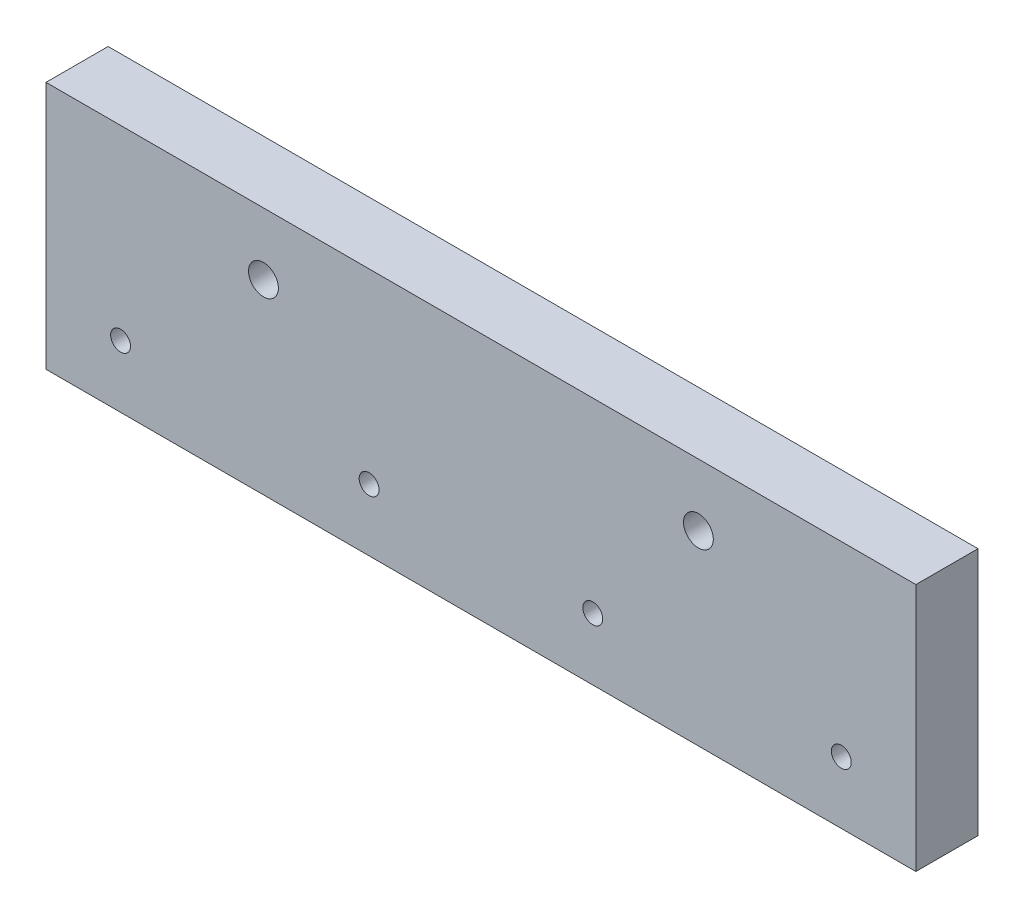
ISO-10303-21;
HEADER;
FILE_DESCRIPTION(('STEP AP214'),'2;1');
FILE_NAME('part.step','',(''),(''),'','','');
FILE_SCHEMA(('AUTOMOTIVE_DESIGN { 1 0 10303 214 1 1 1 1 }'));
ENDSEC;
DATA;
#1=APPLICATION_CONTEXT('core data for automotive mechanical design processes');
#2=APPLICATION_PROTOCOL_DEFINITION('international standard','automotive_design',2000,#1);
#3=PRODUCT_CONTEXT('',#1,'mechanical');
#4=PRODUCT('Part','Part','',(#3));
#5=PRODUCT_RELATED_PRODUCT_CATEGORY('part','',(#4));
#6=PRODUCT_DEFINITION_FORMATION('','',#4);
#7=PRODUCT_DEFINITION_CONTEXT('part definition',#1,'design');
#8=PRODUCT_DEFINITION('design','',#6,#7);
#9=PRODUCT_DEFINITION_SHAPE('','',#8);
#10=(LENGTH_UNIT() NAMED_UNIT(*) SI_UNIT(.MILLI.,.METRE.));
#11=(NAMED_UNIT(*) PLANE_ANGLE_UNIT() SI_UNIT($,.RADIAN.));
#12=(NAMED_UNIT(*) SI_UNIT($,.STERADIAN.) SOLID_ANGLE_UNIT());
#13=UNCERTAINTY_MEASURE_WITH_UNIT(LENGTH_MEASURE(1.E-05),#10,'distance_accuracy_value','');
#14=(GEOMETRIC_REPRESENTATION_CONTEXT(3) GLOBAL_UNCERTAINTY_ASSIGNED_CONTEXT((#13)) GLOBAL_UNIT_ASSIGNED_CONTEXT((#10,
#11,#12)) REPRESENTATION_CONTEXT('',''));
#15=CARTESIAN_POINT('',(0.,0.,0.));
#16=DIRECTION('',(0.,0.,1.));
#17=DIRECTION('',(1.,0.,0.));
#18=AXIS2_PLACEMENT_3D('',#15,#16,#17);
#19=CARTESIAN_POINT('',(0.,0.,6.35));
#20=DIRECTION('',(1.,0.,0.));
#21=DIRECTION('',(0.,0.,-1.));
#22=AXIS2_PLACEMENT_3D('',#19,#20,#21);
#23=PLANE('',#22);
#24=DIRECTION('',(0.,-1.,0.));
#25=VECTOR('',#24,1.);
#26=CARTESIAN_POINT('',(0.,0.,0.));
#27=LINE('',#26,#25);
#28=CARTESIAN_POINT('',(0.,25.4,0.));
#29=VERTEX_POINT('',#28);
#30=CARTESIAN_POINT('',(0.,0.,0.));
#31=VERTEX_POINT('',#30);
#32=EDGE_CURVE('E97',#29,#31,#27,.T.);
#33=ORIENTED_EDGE('',*,*,#32,.T.);
#34=DIRECTION('',(0.,0.,-1.));
#35=VECTOR('',#34,1.);
#36=CARTESIAN_POINT('',(0.,0.,6.35));
#37=LINE('',#36,#35);
#38=CARTESIAN_POINT('',(0.,0.,6.35));
#39=VERTEX_POINT('',#38);
#40=EDGE_CURVE('E11',#39,#31,#37,.T.);
#41=ORIENTED_EDGE('',*,*,#40,.F.);
#42=DIRECTION('',(0.,-1.,0.));
#43=VECTOR('',#42,1.);
#44=CARTESIAN_POINT('',(0.,0.,6.35));
#45=LINE('',#44,#43);
#46=CARTESIAN_POINT('',(0.,25.4,6.35));
#47=VERTEX_POINT('',#46);
#48=EDGE_CURVE('E85',#47,#39,#45,.T.);
#49=ORIENTED_EDGE('',*,*,#48,.F.);
#50=DIRECTION('',(0.,0.,-1.));
#51=VECTOR('',#50,1.);
#52=CARTESIAN_POINT('',(0.,25.4,6.35));
#53=LINE('',#52,#51);
#54=EDGE_CURVE('E93',#47,#29,#53,.T.);
#55=ORIENTED_EDGE('',*,*,#54,.T.);
#56=EDGE_LOOP('',(#33,#41,#49,#55));
#57=FACE_BOUND('',#56,.T.);
#58=ADVANCED_FACE('F34',(#57),#23,.F.);
#59=CARTESIAN_POINT('',(0.,0.,6.35));
#60=DIRECTION('',(0.,1.,0.));
#61=DIRECTION('',(0.,0.,1.));
#62=AXIS2_PLACEMENT_3D('',#59,#60,#61);
#63=PLANE('',#62);
#64=DIRECTION('',(1.,0.,0.));
#65=VECTOR('',#64,1.);
#66=CARTESIAN_POINT('',(0.,0.,0.));
#67=LINE('',#66,#65);
#68=CARTESIAN_POINT('',(88.9,0.,0.));
#69=VERTEX_POINT('',#68);
#70=EDGE_CURVE('E89',#31,#69,#67,.T.);
#71=ORIENTED_EDGE('',*,*,#70,.T.);
#72=DIRECTION('',(0.,0.,-1.));
#73=VECTOR('',#72,1.);
#74=CARTESIAN_POINT('',(88.9,0.,6.35));
#75=LINE('',#74,#73);
#76=CARTESIAN_POINT('',(88.9,0.,6.35));
#77=VERTEX_POINT('',#76);
#78=EDGE_CURVE('E42',#77,#69,#75,.T.);
#79=ORIENTED_EDGE('',*,*,#78,.F.);
#80=DIRECTION('',(1.,0.,0.));
#81=VECTOR('',#80,1.);
#82=CARTESIAN_POINT('',(0.,0.,6.35));
#83=LINE('',#82,#81);
#84=EDGE_CURVE('E80',#39,#77,#83,.T.);
#85=ORIENTED_EDGE('',*,*,#84,.F.);
#86=ORIENTED_EDGE('',*,*,#40,.T.);
#87=EDGE_LOOP('',(#71,#79,#85,#86));
#88=FACE_BOUND('',#87,.T.);
#89=ADVANCED_FACE('F88',(#88),#63,.F.);
#90=CARTESIAN_POINT('',(88.9,0.,6.35));
#91=DIRECTION('',(-1.,0.,0.));
#92=DIRECTION('',(0.,0.,1.));
#93=AXIS2_PLACEMENT_3D('',#90,#91,#92);
#94=PLANE('',#93);
#95=DIRECTION('',(0.,1.,0.));
#96=VECTOR('',#95,1.);
#97=CARTESIAN_POINT('',(88.9,0.,0.));
#98=LINE('',#97,#96);
#99=CARTESIAN_POINT('',(88.9,25.4,0.));
#100=VERTEX_POINT('',#99);
#101=EDGE_CURVE('E67',#69,#100,#98,.T.);
#102=ORIENTED_EDGE('',*,*,#101,.T.);
#103=DIRECTION('',(0.,0.,-1.));
#104=VECTOR('',#103,1.);
#105=CARTESIAN_POINT('',(88.9,25.4,6.35));
#106=LINE('',#105,#104);
#107=CARTESIAN_POINT('',(88.9,25.4,6.35));
#108=VERTEX_POINT('',#107);
#109=EDGE_CURVE('E90',#108,#100,#106,.T.);
#110=ORIENTED_EDGE('',*,*,#109,.F.);
#111=DIRECTION('',(0.,1.,0.));
#112=VECTOR('',#111,1.);
#113=CARTESIAN_POINT('',(88.9,0.,6.35));
#114=LINE('',#113,#112);
#115=EDGE_CURVE('E83',#77,#108,#114,.T.);
#116=ORIENTED_EDGE('',*,*,#115,.F.);
#117=ORIENTED_EDGE('',*,*,#78,.T.);
#118=EDGE_LOOP('',(#102,#110,#116,#117));
#119=FACE_BOUND('',#118,.T.);
#120=ADVANCED_FACE('F91',(#119),#94,.F.);
#121=CARTESIAN_POINT('',(0.,25.4,6.35));
#122=DIRECTION('',(0.,-1.,0.));
#123=DIRECTION('',(0.,0.,-1.));
#124=AXIS2_PLACEMENT_3D('',#121,#122,#123);
#125=PLANE('',#124);
#126=DIRECTION('',(-1.,0.,0.));
#127=VECTOR('',#126,1.);
#128=CARTESIAN_POINT('',(0.,25.4,0.));
#129=LINE('',#128,#127);
#130=EDGE_CURVE('E73',#100,#29,#129,.T.);
#131=ORIENTED_EDGE('',*,*,#130,.T.);
#132=ORIENTED_EDGE('',*,*,#54,.F.);
#133=DIRECTION('',(-1.,0.,0.));
#134=VECTOR('',#133,1.);
#135=CARTESIAN_POINT('',(0.,25.4,6.35));
#136=LINE('',#135,#134);
#137=EDGE_CURVE('E50',#108,#47,#136,.T.);
#138=ORIENTED_EDGE('',*,*,#137,.F.);
#139=ORIENTED_EDGE('',*,*,#109,.T.);
#140=EDGE_LOOP('',(#131,#132,#138,#139));
#141=FACE_BOUND('',#140,.T.);
#142=ADVANCED_FACE('F105',(#141),#125,.F.);
#143=CARTESIAN_POINT('',(0.,0.,6.35));
#144=DIRECTION('',(0.,0.,-1.));
#145=DIRECTION('',(-1.,0.,0.));
#146=AXIS2_PLACEMENT_3D('',#143,#144,#145);
#147=PLANE('',#146);
#148=CARTESIAN_POINT('',(66.675,19.05,6.35));
#149=DIRECTION('',(0.,0.,1.));
#150=DIRECTION('',(-1.,0.,0.));
#151=AXIS2_PLACEMENT_3D('',#148,#149,#150);
#152=CIRCLE('',#151,1.52400000000001);
#153=CARTESIAN_POINT('',(65.151,19.05,6.35));
#154=VERTEX_POINT('',#153);
#155=EDGE_CURVE('E141',#154,#154,#152,.T.);
#156=ORIENTED_EDGE('',*,*,#155,.F.);
#157=EDGE_LOOP('',(#156));
#158=FACE_BOUND('',#157,.T.);
#159=CARTESIAN_POINT('',(22.225,19.05,6.35));
#160=DIRECTION('',(0.,0.,1.));
#161=DIRECTION('',(1.,0.,0.));
#162=AXIS2_PLACEMENT_3D('',#159,#160,#161);
#163=CIRCLE('',#162,1.524);
#164=CARTESIAN_POINT('',(23.749,19.05,6.35));
#165=VERTEX_POINT('',#164);
#166=EDGE_CURVE('E135',#165,#165,#163,.T.);
#167=ORIENTED_EDGE('',*,*,#166,.F.);
#168=EDGE_LOOP('',(#167));
#169=FACE_BOUND('',#168,.T.);
#170=CARTESIAN_POINT('',(81.28,6.35000000000001,6.35));
#171=DIRECTION('',(0.,0.,1.));
#172=DIRECTION('',(-1.,0.,0.));
#173=AXIS2_PLACEMENT_3D('',#170,#171,#172);
#174=CIRCLE('',#173,1.01599999999999);
#175=CARTESIAN_POINT('',(80.264,6.35000000000001,6.35));
#176=VERTEX_POINT('',#175);
#177=EDGE_CURVE('E129',#176,#176,#174,.T.);
#178=ORIENTED_EDGE('',*,*,#177,.F.);
#179=EDGE_LOOP('',(#178));
#180=FACE_BOUND('',#179,.T.);
#181=CARTESIAN_POINT('',(55.88,6.35000000000001,6.35));
#182=DIRECTION('',(0.,0.,1.));
#183=DIRECTION('',(-1.,0.,0.));
#184=AXIS2_PLACEMENT_3D('',#181,#182,#183);
#185=CIRCLE('',#184,1.016);
#186=CARTESIAN_POINT('',(54.864,6.35000000000001,6.35));
#187=VERTEX_POINT('',#186);
#188=EDGE_CURVE('E123',#187,#187,#185,.T.);
#189=ORIENTED_EDGE('',*,*,#188,.F.);
#190=EDGE_LOOP('',(#189));
#191=FACE_BOUND('',#190,.T.);
#192=CARTESIAN_POINT('',(33.02,6.35000000000001,6.35));
#193=DIRECTION('',(0.,0.,1.));
#194=DIRECTION('',(1.,0.,0.));
#195=AXIS2_PLACEMENT_3D('',#192,#193,#194);
#196=CIRCLE('',#195,1.016);
#197=CARTESIAN_POINT('',(34.036,6.35000000000001,6.35));
#198=VERTEX_POINT('',#197);
#199=EDGE_CURVE('E117',#198,#198,#196,.T.);
#200=ORIENTED_EDGE('',*,*,#199,.F.);
#201=EDGE_LOOP('',(#200));
#202=FACE_BOUND('',#201,.T.);
#203=CARTESIAN_POINT('',(7.62,6.35,6.35));
#204=DIRECTION('',(0.,0.,1.));
#205=DIRECTION('',(1.,0.,0.));
#206=AXIS2_PLACEMENT_3D('',#203,#204,#205);
#207=CIRCLE('',#206,1.016);
#208=CARTESIAN_POINT('',(8.636,6.35,6.35));
#209=VERTEX_POINT('',#208);
#210=EDGE_CURVE('E111',#209,#209,#207,.T.);
#211=ORIENTED_EDGE('',*,*,#210,.F.);
#212=EDGE_LOOP('',(#211));
#213=FACE_BOUND('',#212,.T.);
#214=ORIENTED_EDGE('',*,*,#48,.T.);
#215=ORIENTED_EDGE('',*,*,#84,.T.);
#216=ORIENTED_EDGE('',*,*,#115,.T.);
#217=ORIENTED_EDGE('',*,*,#137,.T.);
#218=EDGE_LOOP('',(#214,#215,#216,#217));
#219=FACE_BOUND('',#218,.T.);
#220=ADVANCED_FACE('F81',(#158,#169,#180,#191,#202,#213,#219),#147,.F.);
#221=CARTESIAN_POINT('',(0.,0.,0.));
#222=DIRECTION('',(0.,0.,-1.));
#223=DIRECTION('',(-1.,0.,0.));
#224=AXIS2_PLACEMENT_3D('',#221,#222,#223);
#225=PLANE('',#224);
#226=CARTESIAN_POINT('',(66.675,19.05,0.));
#227=DIRECTION('',(0.,0.,1.));
#228=DIRECTION('',(-1.,0.,0.));
#229=AXIS2_PLACEMENT_3D('',#226,#227,#228);
#230=CIRCLE('',#229,1.52400000000001);
#231=CARTESIAN_POINT('',(65.151,19.05,0.));
#232=VERTEX_POINT('',#231);
#233=EDGE_CURVE('E138',#232,#232,#230,.T.);
#234=ORIENTED_EDGE('',*,*,#233,.T.);
#235=EDGE_LOOP('',(#234));
#236=FACE_BOUND('',#235,.T.);
#237=CARTESIAN_POINT('',(22.225,19.05,0.));
#238=DIRECTION('',(0.,0.,1.));
#239=DIRECTION('',(1.,0.,0.));
#240=AXIS2_PLACEMENT_3D('',#237,#238,#239);
#241=CIRCLE('',#240,1.524);
#242=CARTESIAN_POINT('',(23.749,19.05,0.));
#243=VERTEX_POINT('',#242);
#244=EDGE_CURVE('E132',#243,#243,#241,.T.);
#245=ORIENTED_EDGE('',*,*,#244,.T.);
#246=EDGE_LOOP('',(#245));
#247=FACE_BOUND('',#246,.T.);
#248=CARTESIAN_POINT('',(81.28,6.35000000000001,0.));
#249=DIRECTION('',(0.,0.,1.));
#250=DIRECTION('',(-1.,0.,0.));
#251=AXIS2_PLACEMENT_3D('',#248,#249,#250);
#252=CIRCLE('',#251,1.01599999999999);
#253=CARTESIAN_POINT('',(80.264,6.35000000000001,0.));
#254=VERTEX_POINT('',#253);
#255=EDGE_CURVE('E126',#254,#254,#252,.T.);
#256=ORIENTED_EDGE('',*,*,#255,.T.);
#257=EDGE_LOOP('',(#256));
#258=FACE_BOUND('',#257,.T.);
#259=CARTESIAN_POINT('',(55.88,6.35000000000001,0.));
#260=DIRECTION('',(0.,0.,1.));
#261=DIRECTION('',(-1.,0.,0.));
#262=AXIS2_PLACEMENT_3D('',#259,#260,#261);
#263=CIRCLE('',#262,1.016);
#264=CARTESIAN_POINT('',(54.864,6.35000000000001,0.));
#265=VERTEX_POINT('',#264);
#266=EDGE_CURVE('E120',#265,#265,#263,.T.);
#267=ORIENTED_EDGE('',*,*,#266,.T.);
#268=EDGE_LOOP('',(#267));
#269=FACE_BOUND('',#268,.T.);
#270=CARTESIAN_POINT('',(33.02,6.35000000000001,0.));
#271=DIRECTION('',(0.,0.,1.));
#272=DIRECTION('',(1.,0.,0.));
#273=AXIS2_PLACEMENT_3D('',#270,#271,#272);
#274=CIRCLE('',#273,1.016);
#275=CARTESIAN_POINT('',(34.036,6.35000000000001,0.));
#276=VERTEX_POINT('',#275);
#277=EDGE_CURVE('E114',#276,#276,#274,.T.);
#278=ORIENTED_EDGE('',*,*,#277,.T.);
#279=EDGE_LOOP('',(#278));
#280=FACE_BOUND('',#279,.T.);
#281=CARTESIAN_POINT('',(7.62,6.35,0.));
#282=DIRECTION('',(0.,0.,1.));
#283=DIRECTION('',(1.,0.,0.));
#284=AXIS2_PLACEMENT_3D('',#281,#282,#283);
#285=CIRCLE('',#284,1.016);
#286=CARTESIAN_POINT('',(8.636,6.35,0.));
#287=VERTEX_POINT('',#286);
#288=EDGE_CURVE('E100',#287,#287,#285,.T.);
#289=ORIENTED_EDGE('',*,*,#288,.T.);
#290=EDGE_LOOP('',(#289));
#291=FACE_BOUND('',#290,.T.);
#292=ORIENTED_EDGE('',*,*,#32,.F.);
#293=ORIENTED_EDGE('',*,*,#130,.F.);
#294=ORIENTED_EDGE('',*,*,#101,.F.);
#295=ORIENTED_EDGE('',*,*,#70,.F.);
#296=EDGE_LOOP('',(#292,#293,#294,#295));
#297=FACE_BOUND('',#296,.T.);
#298=ADVANCED_FACE('F108',(#236,#247,#258,#269,#280,#291,#297),#225,.T.);
#299=CARTESIAN_POINT('',(7.62,6.35,0.));
#300=DIRECTION('',(0.,0.,1.));
#301=DIRECTION('',(1.,0.,0.));
#302=AXIS2_PLACEMENT_3D('',#299,#300,#301);
#303=CYLINDRICAL_SURFACE('',#302,1.016);
#304=ORIENTED_EDGE('',*,*,#288,.F.);
#305=EDGE_LOOP('',(#304));
#306=FACE_BOUND('',#305,.T.);
#307=ORIENTED_EDGE('',*,*,#210,.T.);
#308=EDGE_LOOP('',(#307));
#309=FACE_BOUND('',#308,.T.);
#310=ADVANCED_FACE('F169',(#306,#309),#303,.F.);
#311=CARTESIAN_POINT('',(33.02,6.35000000000001,0.));
#312=DIRECTION('',(0.,0.,1.));
#313=DIRECTION('',(1.,0.,0.));
#314=AXIS2_PLACEMENT_3D('',#311,#312,#313);
#315=CYLINDRICAL_SURFACE('',#314,1.016);
#316=ORIENTED_EDGE('',*,*,#277,.F.);
#317=EDGE_LOOP('',(#316));
#318=FACE_BOUND('',#317,.T.);
#319=ORIENTED_EDGE('',*,*,#199,.T.);
#320=EDGE_LOOP('',(#319));
#321=FACE_BOUND('',#320,.T.);
#322=ADVANCED_FACE('F171',(#318,#321),#315,.F.);
#323=CARTESIAN_POINT('',(55.88,6.35000000000001,0.));
#324=DIRECTION('',(0.,0.,1.));
#325=DIRECTION('',(1.,0.,0.));
#326=AXIS2_PLACEMENT_3D('',#323,#324,#325);
#327=CYLINDRICAL_SURFACE('',#326,1.016);
#328=ORIENTED_EDGE('',*,*,#266,.F.);
#329=EDGE_LOOP('',(#328));
#330=FACE_BOUND('',#329,.T.);
#331=ORIENTED_EDGE('',*,*,#188,.T.);
#332=EDGE_LOOP('',(#331));
#333=FACE_BOUND('',#332,.T.);
#334=ADVANCED_FACE('F178',(#330,#333),#327,.F.);
#335=CARTESIAN_POINT('',(81.28,6.35000000000001,0.));
#336=DIRECTION('',(0.,0.,1.));
#337=DIRECTION('',(1.,0.,0.));
#338=AXIS2_PLACEMENT_3D('',#335,#336,#337);
#339=CYLINDRICAL_SURFACE('',#338,1.01599999999999);
#340=ORIENTED_EDGE('',*,*,#255,.F.);
#341=EDGE_LOOP('',(#340));
#342=FACE_BOUND('',#341,.T.);
#343=ORIENTED_EDGE('',*,*,#177,.T.);
#344=EDGE_LOOP('',(#343));
#345=FACE_BOUND('',#344,.T.);
#346=ADVANCED_FACE('F216',(#342,#345),#339,.F.);
#347=CARTESIAN_POINT('',(22.225,19.05,0.));
#348=DIRECTION('',(0.,0.,1.));
#349=DIRECTION('',(1.,0.,0.));
#350=AXIS2_PLACEMENT_3D('',#347,#348,#349);
#351=CYLINDRICAL_SURFACE('',#350,1.524);
#352=ORIENTED_EDGE('',*,*,#244,.F.);
#353=EDGE_LOOP('',(#352));
#354=FACE_BOUND('',#353,.T.);
#355=ORIENTED_EDGE('',*,*,#166,.T.);
#356=EDGE_LOOP('',(#355));
#357=FACE_BOUND('',#356,.T.);
#358=ADVANCED_FACE('F152',(#354,#357),#351,.F.);
#359=CARTESIAN_POINT('',(66.675,19.05,0.));
#360=DIRECTION('',(0.,0.,1.));
#361=DIRECTION('',(1.,0.,0.));
#362=AXIS2_PLACEMENT_3D('',#359,#360,#361);
#363=CYLINDRICAL_SURFACE('',#362,1.52400000000001);
#364=ORIENTED_EDGE('',*,*,#233,.F.);
#365=EDGE_LOOP('',(#364));
#366=FACE_BOUND('',#365,.T.);
#367=ORIENTED_EDGE('',*,*,#155,.T.);
#368=EDGE_LOOP('',(#367));
#369=FACE_BOUND('',#368,.T.);
#370=ADVANCED_FACE('F149',(#366,#369),#363,.F.);
#371=CLOSED_SHELL('',(#58,#89,#120,#142,#220,#298,#310,#322,#334,#346,#358,#370));
#372=MANIFOLD_SOLID_BREP('B2',#371);
#373=ADVANCED_BREP_SHAPE_REPRESENTATION('',(#18,#372),#14);
#374=SHAPE_DEFINITION_REPRESENTATION(#9,#373);
ENDSEC;
END-ISO-10303-21;
